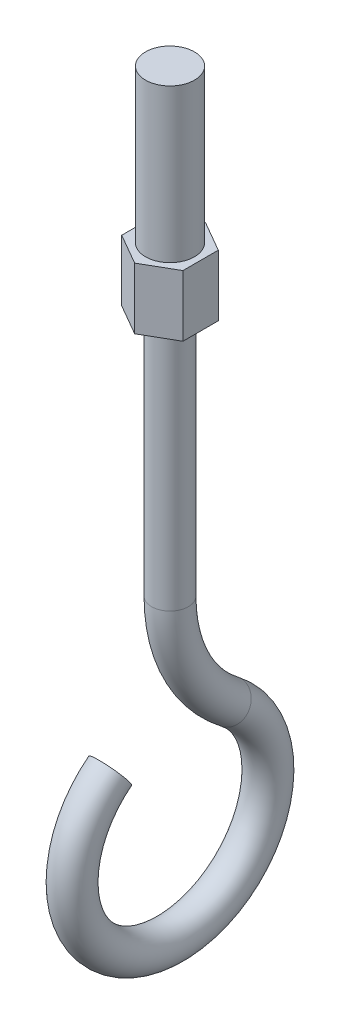
ISO-10303-21;
HEADER;
FILE_DESCRIPTION(('STEP AP214'),'2;1');
FILE_NAME('part.step','',(''),(''),'','','');
FILE_SCHEMA(('AUTOMOTIVE_DESIGN { 1 0 10303 214 1 1 1 1 }'));
ENDSEC;
DATA;
#1=APPLICATION_CONTEXT('core data for automotive mechanical design processes');
#2=APPLICATION_PROTOCOL_DEFINITION('international standard','automotive_design',2000,#1);
#3=PRODUCT_CONTEXT('',#1,'mechanical');
#4=PRODUCT('Part','Part','',(#3));
#5=PRODUCT_RELATED_PRODUCT_CATEGORY('part','',(#4));
#6=PRODUCT_DEFINITION_FORMATION('','',#4);
#7=PRODUCT_DEFINITION_CONTEXT('part definition',#1,'design');
#8=PRODUCT_DEFINITION('design','',#6,#7);
#9=PRODUCT_DEFINITION_SHAPE('','',#8);
#10=(LENGTH_UNIT() NAMED_UNIT(*) SI_UNIT(.MILLI.,.METRE.));
#11=(NAMED_UNIT(*) PLANE_ANGLE_UNIT() SI_UNIT($,.RADIAN.));
#12=(NAMED_UNIT(*) SI_UNIT($,.STERADIAN.) SOLID_ANGLE_UNIT());
#13=UNCERTAINTY_MEASURE_WITH_UNIT(LENGTH_MEASURE(1.E-05),#10,'distance_accuracy_value','');
#14=(GEOMETRIC_REPRESENTATION_CONTEXT(3) GLOBAL_UNCERTAINTY_ASSIGNED_CONTEXT((#13)) GLOBAL_UNIT_ASSIGNED_CONTEXT((#10,
#11,#12)) REPRESENTATION_CONTEXT('',''));
#15=CARTESIAN_POINT('',(0.,0.,0.));
#16=DIRECTION('',(0.,0.,1.));
#17=DIRECTION('',(1.,0.,0.));
#18=AXIS2_PLACEMENT_3D('',#15,#16,#17);
#19=CARTESIAN_POINT('',(0.,-75.9647043265553,12.390243902439));
#20=DIRECTION('',(0.,-0.609756097560976,0.79258911264741));
#21=DIRECTION('',(0.,-0.79258911264741,-0.609756097560976));
#22=AXIS2_PLACEMENT_3D('',#19,#20,#21);
#23=PLANE('',#22);
#24=CARTESIAN_POINT('',(0.,-75.9647043265553,12.390243902439));
#25=DIRECTION('',(0.,-0.609756097560976,0.79258911264741));
#26=DIRECTION('',(0.,-0.79258911264741,-0.609756097560976));
#27=AXIS2_PLACEMENT_3D('',#24,#25,#26);
#28=CIRCLE('',#27,3.81);
#29=CARTESIAN_POINT('',(0.,-78.9844688457419,10.0670731707317));
#30=VERTEX_POINT('',#29);
#31=EDGE_CURVE('E11',#30,#30,#28,.T.);
#32=ORIENTED_EDGE('',*,*,#31,.F.);
#33=EDGE_LOOP('',(#32));
#34=FACE_BOUND('',#33,.T.);
#35=ADVANCED_FACE('F16',(#34),#23,.F.);
#36=CARTESIAN_POINT('',(0.,0.,0.));
#37=DIRECTION('',(0.,-1.,0.));
#38=DIRECTION('',(0.,0.,-1.));
#39=AXIS2_PLACEMENT_3D('',#36,#37,#38);
#40=CYLINDRICAL_SURFACE('',#39,3.81);
#41=CARTESIAN_POINT('',(0.,-50.8,0.));
#42=DIRECTION('',(0.,1.,0.));
#43=DIRECTION('',(0.,0.,1.));
#44=AXIS2_PLACEMENT_3D('',#41,#42,#43);
#45=CIRCLE('',#44,3.81);
#46=CARTESIAN_POINT('',(0.,-50.8,3.81));
#47=VERTEX_POINT('',#46);
#48=EDGE_CURVE('E128',#47,#47,#45,.T.);
#49=ORIENTED_EDGE('',*,*,#48,.T.);
#50=EDGE_LOOP('',(#49));
#51=FACE_BOUND('',#50,.T.);
#52=CARTESIAN_POINT('',(0.,0.,0.));
#53=DIRECTION('',(0.,1.,0.));
#54=DIRECTION('',(0.,0.,1.));
#55=AXIS2_PLACEMENT_3D('',#52,#53,#54);
#56=CIRCLE('',#55,3.81);
#57=CARTESIAN_POINT('',(0.,0.,3.81));
#58=VERTEX_POINT('',#57);
#59=EDGE_CURVE('E125',#58,#58,#56,.T.);
#60=ORIENTED_EDGE('',*,*,#59,.F.);
#61=EDGE_LOOP('',(#60));
#62=FACE_BOUND('',#61,.T.);
#63=ADVANCED_FACE('F148',(#51,#62),#40,.T.);
#64=CARTESIAN_POINT('',(0.,-50.8,-31.75));
#65=DIRECTION('',(1.,0.,0.));
#66=DIRECTION('',(0.,0.,-1.));
#67=AXIS2_PLACEMENT_3D('',#64,#65,#66);
#68=TOROIDAL_SURFACE('',#67,31.75,3.81);
#69=CARTESIAN_POINT('',(0.,-75.9647043265553,-12.390243902439));
#70=DIRECTION('',(0.,0.609756097560976,0.792589112647411));
#71=DIRECTION('',(0.,-0.792589112647411,0.609756097560976));
#72=AXIS2_PLACEMENT_3D('',#69,#70,#71);
#73=CIRCLE('',#72,3.81);
#74=CARTESIAN_POINT('',(0.,-78.9844688457419,-10.0670731707317));
#75=VERTEX_POINT('',#74);
#76=EDGE_CURVE('E24',#75,#75,#73,.T.);
#77=CARTESIAN_POINT('',(0.,-50.8,-31.75));
#78=DIRECTION('',(1.,0.,0.));
#79=DIRECTION('',(0.,0.,-1.));
#80=AXIS2_PLACEMENT_3D('',#77,#78,#79);
#81=CIRCLE('',#80,35.56);
#82=EDGE_CURVE('',#47,#75,#81,.T.);
#83=ORIENTED_EDGE('',*,*,#48,.F.);
#84=ORIENTED_EDGE('',*,*,#76,.T.);
#85=ORIENTED_EDGE('',*,*,#82,.T.);
#86=ORIENTED_EDGE('',*,*,#82,.F.);
#87=EDGE_LOOP('',(#83,#85,#84,#86));
#88=FACE_BOUND('',#87,.T.);
#89=ADVANCED_FACE('F133',(#88),#68,.T.);
#90=CARTESIAN_POINT('',(0.,-92.0701150955507,0.));
#91=DIRECTION('',(-1.,0.,0.));
#92=DIRECTION('',(0.,0.,1.));
#93=AXIS2_PLACEMENT_3D('',#90,#91,#92);
#94=TOROIDAL_SURFACE('',#93,20.32,3.81);
#95=ORIENTED_EDGE('',*,*,#31,.T.);
#96=EDGE_LOOP('',(#95));
#97=FACE_BOUND('',#96,.T.);
#98=ORIENTED_EDGE('',*,*,#76,.F.);
#99=EDGE_LOOP('',(#98));
#100=FACE_BOUND('',#99,.T.);
#101=ADVANCED_FACE('F136',(#97,#100),#94,.T.);
#102=CARTESIAN_POINT('',(0.,0.,0.));
#103=DIRECTION('',(0.,1.,0.));
#104=DIRECTION('',(0.,0.,1.));
#105=AXIS2_PLACEMENT_3D('',#102,#103,#104);
#106=PLANE('',#105);
#107=ORIENTED_EDGE('',*,*,#59,.T.);
#108=EDGE_LOOP('',(#107));
#109=FACE_BOUND('',#108,.T.);
#110=DIRECTION('',(0.,0.,-1.));
#111=VECTOR('',#110,1.);
#112=CARTESIAN_POINT('',(6.35,0.,3.66617420935412));
#113=LINE('',#112,#111);
#114=CARTESIAN_POINT('',(6.35,0.,3.66617420935412));
#115=VERTEX_POINT('',#114);
#116=CARTESIAN_POINT('',(6.35,0.,-3.66617420935412));
#117=VERTEX_POINT('',#116);
#118=EDGE_CURVE('E102',#115,#117,#113,.T.);
#119=ORIENTED_EDGE('',*,*,#118,.F.);
#120=DIRECTION('',(0.866025403784439,0.,-0.5));
#121=VECTOR('',#120,1.);
#122=CARTESIAN_POINT('',(0.,0.,7.33234841870825));
#123=LINE('',#122,#121);
#124=CARTESIAN_POINT('',(0.,0.,7.33234841870825));
#125=VERTEX_POINT('',#124);
#126=EDGE_CURVE('E61',#125,#115,#123,.T.);
#127=ORIENTED_EDGE('',*,*,#126,.F.);
#128=DIRECTION('',(0.866025403784438,0.,0.5));
#129=VECTOR('',#128,1.);
#130=CARTESIAN_POINT('',(-6.35,0.,3.66617420935412));
#131=LINE('',#130,#129);
#132=CARTESIAN_POINT('',(-6.35,0.,3.66617420935412));
#133=VERTEX_POINT('',#132);
#134=EDGE_CURVE('E55',#133,#125,#131,.T.);
#135=ORIENTED_EDGE('',*,*,#134,.F.);
#136=DIRECTION('',(0.,0.,1.));
#137=VECTOR('',#136,1.);
#138=CARTESIAN_POINT('',(-6.35,0.,-3.66617420935412));
#139=LINE('',#138,#137);
#140=CARTESIAN_POINT('',(-6.35,0.,-3.66617420935412));
#141=VERTEX_POINT('',#140);
#142=EDGE_CURVE('E92',#141,#133,#139,.T.);
#143=ORIENTED_EDGE('',*,*,#142,.F.);
#144=DIRECTION('',(-0.866025403784439,0.,0.5));
#145=VECTOR('',#144,1.);
#146=CARTESIAN_POINT('',(0.,0.,-7.33234841870825));
#147=LINE('',#146,#145);
#148=CARTESIAN_POINT('',(0.,0.,-7.33234841870825));
#149=VERTEX_POINT('',#148);
#150=EDGE_CURVE('E108',#149,#141,#147,.T.);
#151=ORIENTED_EDGE('',*,*,#150,.F.);
#152=DIRECTION('',(-0.866025403784439,0.,-0.5));
#153=VECTOR('',#152,1.);
#154=CARTESIAN_POINT('',(6.35,0.,-3.66617420935412));
#155=LINE('',#154,#153);
#156=EDGE_CURVE('E105',#117,#149,#155,.T.);
#157=ORIENTED_EDGE('',*,*,#156,.F.);
#158=EDGE_LOOP('',(#119,#127,#135,#143,#151,#157));
#159=FACE_BOUND('',#158,.T.);
#160=ADVANCED_FACE('F138',(#109,#159),#106,.F.);
#161=CARTESIAN_POINT('',(0.,12.7,0.));
#162=DIRECTION('',(0.,1.,0.));
#163=DIRECTION('',(0.,0.,1.));
#164=AXIS2_PLACEMENT_3D('',#161,#162,#163);
#165=PLANE('',#164);
#166=DIRECTION('',(0.,0.,-1.));
#167=VECTOR('',#166,1.);
#168=CARTESIAN_POINT('',(6.35,12.7,3.66617420935413));
#169=LINE('',#168,#167);
#170=CARTESIAN_POINT('',(6.35,12.7,3.66617420935413));
#171=VERTEX_POINT('',#170);
#172=CARTESIAN_POINT('',(6.35,12.7,-3.66617420935412));
#173=VERTEX_POINT('',#172);
#174=EDGE_CURVE('E113',#171,#173,#169,.T.);
#175=ORIENTED_EDGE('',*,*,#174,.T.);
#176=DIRECTION('',(-0.866025403784439,0.,-0.5));
#177=VECTOR('',#176,1.);
#178=CARTESIAN_POINT('',(6.35,12.7,-3.66617420935412));
#179=LINE('',#178,#177);
#180=CARTESIAN_POINT('',(0.,12.7,-7.33234841870825));
#181=VERTEX_POINT('',#180);
#182=EDGE_CURVE('E70',#173,#181,#179,.T.);
#183=ORIENTED_EDGE('',*,*,#182,.T.);
#184=DIRECTION('',(-0.866025403784439,0.,0.5));
#185=VECTOR('',#184,1.);
#186=CARTESIAN_POINT('',(0.,12.7,-7.33234841870825));
#187=LINE('',#186,#185);
#188=CARTESIAN_POINT('',(-6.35,12.7,-3.66617420935412));
#189=VERTEX_POINT('',#188);
#190=EDGE_CURVE('E84',#181,#189,#187,.T.);
#191=ORIENTED_EDGE('',*,*,#190,.T.);
#192=DIRECTION('',(0.,0.,1.));
#193=VECTOR('',#192,1.);
#194=CARTESIAN_POINT('',(-6.35,12.7,-3.66617420935412));
#195=LINE('',#194,#193);
#196=CARTESIAN_POINT('',(-6.35,12.7,3.66617420935413));
#197=VERTEX_POINT('',#196);
#198=EDGE_CURVE('E77',#189,#197,#195,.T.);
#199=ORIENTED_EDGE('',*,*,#198,.T.);
#200=DIRECTION('',(0.866025403784438,0.,0.5));
#201=VECTOR('',#200,1.);
#202=CARTESIAN_POINT('',(-6.35,12.7,3.66617420935413));
#203=LINE('',#202,#201);
#204=CARTESIAN_POINT('',(0.,12.7,7.33234841870826));
#205=VERTEX_POINT('',#204);
#206=EDGE_CURVE('E82',#197,#205,#203,.T.);
#207=ORIENTED_EDGE('',*,*,#206,.T.);
#208=DIRECTION('',(0.866025403784439,0.,-0.5));
#209=VECTOR('',#208,1.);
#210=CARTESIAN_POINT('',(0.,12.7,7.33234841870826));
#211=LINE('',#210,#209);
#212=EDGE_CURVE('E32',#205,#171,#211,.T.);
#213=ORIENTED_EDGE('',*,*,#212,.T.);
#214=EDGE_LOOP('',(#175,#183,#191,#199,#207,#213));
#215=FACE_BOUND('',#214,.T.);
#216=CARTESIAN_POINT('',(0.,12.7,0.));
#217=DIRECTION('',(0.,1.,0.));
#218=DIRECTION('',(0.,0.,1.));
#219=AXIS2_PLACEMENT_3D('',#216,#217,#218);
#220=CIRCLE('',#219,5.08);
#221=CARTESIAN_POINT('',(0.,12.7,5.08));
#222=VERTEX_POINT('',#221);
#223=EDGE_CURVE('E106',#222,#222,#220,.T.);
#224=ORIENTED_EDGE('',*,*,#223,.F.);
#225=EDGE_LOOP('',(#224));
#226=FACE_BOUND('',#225,.T.);
#227=ADVANCED_FACE('F79',(#215,#226),#165,.T.);
#228=CARTESIAN_POINT('',(6.35,12.7,3.66617420935413));
#229=DIRECTION('',(-1.,0.,0.));
#230=DIRECTION('',(0.,0.,1.));
#231=AXIS2_PLACEMENT_3D('',#228,#229,#230);
#232=PLANE('',#231);
#233=ORIENTED_EDGE('',*,*,#118,.T.);
#234=DIRECTION('',(0.,-1.,0.));
#235=VECTOR('',#234,1.);
#236=CARTESIAN_POINT('',(6.35,12.7,-3.66617420935412));
#237=LINE('',#236,#235);
#238=EDGE_CURVE('E120',#173,#117,#237,.T.);
#239=ORIENTED_EDGE('',*,*,#238,.F.);
#240=ORIENTED_EDGE('',*,*,#174,.F.);
#241=DIRECTION('',(0.,-1.,0.));
#242=VECTOR('',#241,1.);
#243=CARTESIAN_POINT('',(6.35,12.7,3.66617420935413));
#244=LINE('',#243,#242);
#245=EDGE_CURVE('E98',#171,#115,#244,.T.);
#246=ORIENTED_EDGE('',*,*,#245,.T.);
#247=EDGE_LOOP('',(#233,#239,#240,#246));
#248=FACE_BOUND('',#247,.T.);
#249=ADVANCED_FACE('F163',(#248),#232,.F.);
#250=CARTESIAN_POINT('',(6.35,12.7,-3.66617420935412));
#251=DIRECTION('',(-0.5,0.,0.866025403784438));
#252=DIRECTION('',(0.866025403784439,0.,0.5));
#253=AXIS2_PLACEMENT_3D('',#250,#251,#252);
#254=PLANE('',#253);
#255=ORIENTED_EDGE('',*,*,#156,.T.);
#256=DIRECTION('',(0.,-1.,0.));
#257=VECTOR('',#256,1.);
#258=CARTESIAN_POINT('',(0.,12.7,-7.33234841870825));
#259=LINE('',#258,#257);
#260=EDGE_CURVE('E117',#181,#149,#259,.T.);
#261=ORIENTED_EDGE('',*,*,#260,.F.);
#262=ORIENTED_EDGE('',*,*,#182,.F.);
#263=ORIENTED_EDGE('',*,*,#238,.T.);
#264=EDGE_LOOP('',(#255,#261,#262,#263));
#265=FACE_BOUND('',#264,.T.);
#266=ADVANCED_FACE('F166',(#265),#254,.F.);
#267=CARTESIAN_POINT('',(0.,12.7,-7.33234841870825));
#268=DIRECTION('',(0.5,0.,0.866025403784439));
#269=DIRECTION('',(0.866025403784439,0.,-0.5));
#270=AXIS2_PLACEMENT_3D('',#267,#268,#269);
#271=PLANE('',#270);
#272=ORIENTED_EDGE('',*,*,#150,.T.);
#273=DIRECTION('',(0.,-1.,0.));
#274=VECTOR('',#273,1.);
#275=CARTESIAN_POINT('',(-6.35,12.7,-3.66617420935412));
#276=LINE('',#275,#274);
#277=EDGE_CURVE('E93',#189,#141,#276,.T.);
#278=ORIENTED_EDGE('',*,*,#277,.F.);
#279=ORIENTED_EDGE('',*,*,#190,.F.);
#280=ORIENTED_EDGE('',*,*,#260,.T.);
#281=EDGE_LOOP('',(#272,#278,#279,#280));
#282=FACE_BOUND('',#281,.T.);
#283=ADVANCED_FACE('F170',(#282),#271,.F.);
#284=CARTESIAN_POINT('',(-6.35,12.7,-3.66617420935412));
#285=DIRECTION('',(1.,0.,0.));
#286=DIRECTION('',(0.,0.,-1.));
#287=AXIS2_PLACEMENT_3D('',#284,#285,#286);
#288=PLANE('',#287);
#289=ORIENTED_EDGE('',*,*,#142,.T.);
#290=DIRECTION('',(0.,-1.,0.));
#291=VECTOR('',#290,1.);
#292=CARTESIAN_POINT('',(-6.35,12.7,3.66617420935413));
#293=LINE('',#292,#291);
#294=EDGE_CURVE('E89',#197,#133,#293,.T.);
#295=ORIENTED_EDGE('',*,*,#294,.F.);
#296=ORIENTED_EDGE('',*,*,#198,.F.);
#297=ORIENTED_EDGE('',*,*,#277,.T.);
#298=EDGE_LOOP('',(#289,#295,#296,#297));
#299=FACE_BOUND('',#298,.T.);
#300=ADVANCED_FACE('F90',(#299),#288,.F.);
#301=CARTESIAN_POINT('',(-6.35,12.7,3.66617420935413));
#302=DIRECTION('',(0.5,0.,-0.866025403784439));
#303=DIRECTION('',(-0.866025403784439,0.,-0.5));
#304=AXIS2_PLACEMENT_3D('',#301,#302,#303);
#305=PLANE('',#304);
#306=ORIENTED_EDGE('',*,*,#134,.T.);
#307=DIRECTION('',(0.,-1.,0.));
#308=VECTOR('',#307,1.);
#309=CARTESIAN_POINT('',(0.,12.7,7.33234841870826));
#310=LINE('',#309,#308);
#311=EDGE_CURVE('E94',#205,#125,#310,.T.);
#312=ORIENTED_EDGE('',*,*,#311,.F.);
#313=ORIENTED_EDGE('',*,*,#206,.F.);
#314=ORIENTED_EDGE('',*,*,#294,.T.);
#315=EDGE_LOOP('',(#306,#312,#313,#314));
#316=FACE_BOUND('',#315,.T.);
#317=ADVANCED_FACE('F96',(#316),#305,.F.);
#318=CARTESIAN_POINT('',(0.,12.7,7.33234841870826));
#319=DIRECTION('',(-0.5,0.,-0.866025403784439));
#320=DIRECTION('',(-0.866025403784439,0.,0.5));
#321=AXIS2_PLACEMENT_3D('',#318,#319,#320);
#322=PLANE('',#321);
#323=ORIENTED_EDGE('',*,*,#126,.T.);
#324=ORIENTED_EDGE('',*,*,#245,.F.);
#325=ORIENTED_EDGE('',*,*,#212,.F.);
#326=ORIENTED_EDGE('',*,*,#311,.T.);
#327=EDGE_LOOP('',(#323,#324,#325,#326));
#328=FACE_BOUND('',#327,.T.);
#329=ADVANCED_FACE('F158',(#328),#322,.F.);
#330=CARTESIAN_POINT('',(0.,44.45,0.));
#331=DIRECTION('',(0.,1.,0.));
#332=DIRECTION('',(0.,0.,1.));
#333=AXIS2_PLACEMENT_3D('',#330,#331,#332);
#334=PLANE('',#333);
#335=CARTESIAN_POINT('',(0.,44.45,0.));
#336=DIRECTION('',(0.,1.,0.));
#337=DIRECTION('',(0.,0.,1.));
#338=AXIS2_PLACEMENT_3D('',#335,#336,#337);
#339=CIRCLE('',#338,5.08);
#340=CARTESIAN_POINT('',(0.,44.45,5.08000000000001));
#341=VERTEX_POINT('',#340);
#342=EDGE_CURVE('E122',#341,#341,#339,.T.);
#343=ORIENTED_EDGE('',*,*,#342,.T.);
#344=EDGE_LOOP('',(#343));
#345=FACE_BOUND('',#344,.T.);
#346=ADVANCED_FACE('F154',(#345),#334,.T.);
#347=CARTESIAN_POINT('',(0.,90.5684097937107,0.));
#348=DIRECTION('',(0.,-1.,0.));
#349=DIRECTION('',(0.,0.,-1.));
#350=AXIS2_PLACEMENT_3D('',#347,#348,#349);
#351=CYLINDRICAL_SURFACE('',#350,5.08);
#352=ORIENTED_EDGE('',*,*,#223,.T.);
#353=EDGE_LOOP('',(#352));
#354=FACE_BOUND('',#353,.T.);
#355=ORIENTED_EDGE('',*,*,#342,.F.);
#356=EDGE_LOOP('',(#355));
#357=FACE_BOUND('',#356,.T.);
#358=ADVANCED_FACE('F157',(#354,#357),#351,.T.);
#359=CLOSED_SHELL('',(#35,#63,#89,#101,#160,#227,#249,#266,#283,#300,#317,#329,#346,#358));
#360=MANIFOLD_SOLID_BREP('B1',#359);
#361=ADVANCED_BREP_SHAPE_REPRESENTATION('',(#18,#360),#14);
#362=SHAPE_DEFINITION_REPRESENTATION(#9,#361);
ENDSEC;
END-ISO-10303-21;
